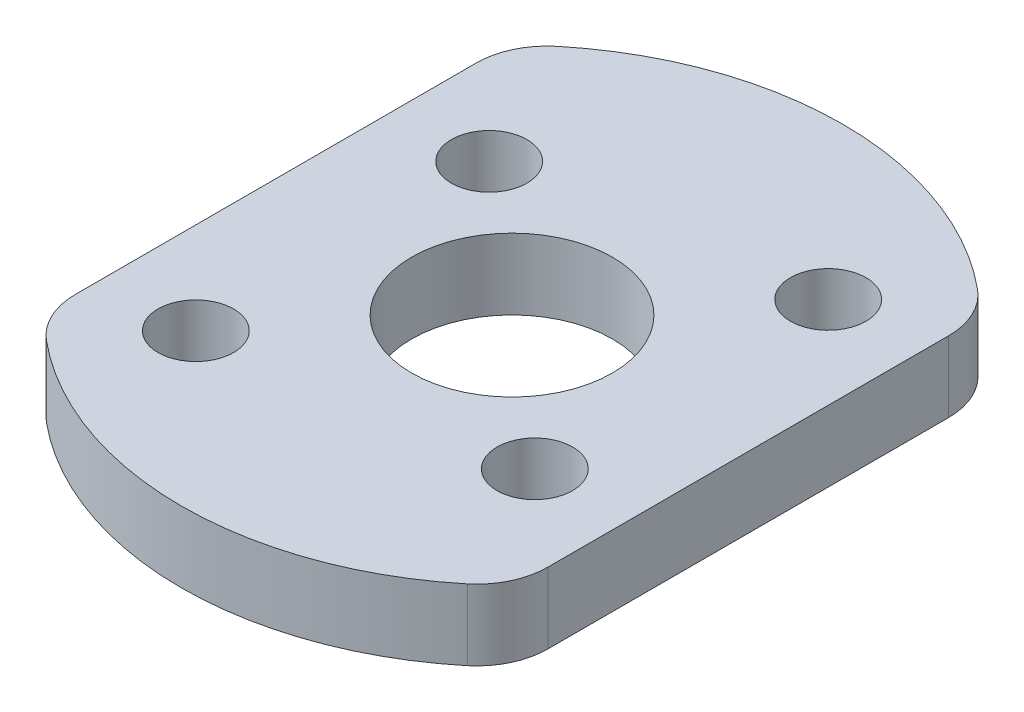
ISO-10303-21;
HEADER;
FILE_DESCRIPTION(('STEP AP214'),'2;1');
FILE_NAME('part.step','',(''),(''),'','','');
FILE_SCHEMA(('AUTOMOTIVE_DESIGN { 1 0 10303 214 1 1 1 1 }'));
ENDSEC;
DATA;
#1=APPLICATION_CONTEXT('core data for automotive mechanical design processes');
#2=APPLICATION_PROTOCOL_DEFINITION('international standard','automotive_design',2000,#1);
#3=PRODUCT_CONTEXT('',#1,'mechanical');
#4=PRODUCT('Part','Part','',(#3));
#5=PRODUCT_RELATED_PRODUCT_CATEGORY('part','',(#4));
#6=PRODUCT_DEFINITION_FORMATION('','',#4);
#7=PRODUCT_DEFINITION_CONTEXT('part definition',#1,'design');
#8=PRODUCT_DEFINITION('design','',#6,#7);
#9=PRODUCT_DEFINITION_SHAPE('','',#8);
#10=(LENGTH_UNIT() NAMED_UNIT(*) SI_UNIT(.MILLI.,.METRE.));
#11=(NAMED_UNIT(*) PLANE_ANGLE_UNIT() SI_UNIT($,.RADIAN.));
#12=(NAMED_UNIT(*) SI_UNIT($,.STERADIAN.) SOLID_ANGLE_UNIT());
#13=UNCERTAINTY_MEASURE_WITH_UNIT(LENGTH_MEASURE(1.E-05),#10,'distance_accuracy_value','');
#14=(GEOMETRIC_REPRESENTATION_CONTEXT(3) GLOBAL_UNCERTAINTY_ASSIGNED_CONTEXT((#13)) GLOBAL_UNIT_ASSIGNED_CONTEXT((#10,
#11,#12)) REPRESENTATION_CONTEXT('',''));
#15=CARTESIAN_POINT('',(0.,0.,0.));
#16=DIRECTION('',(0.,0.,1.));
#17=DIRECTION('',(1.,0.,0.));
#18=AXIS2_PLACEMENT_3D('',#15,#16,#17);
#19=CARTESIAN_POINT('',(0.,3.,0.));
#20=DIRECTION('',(0.,1.,0.));
#21=DIRECTION('',(0.,0.,1.));
#22=AXIS2_PLACEMENT_3D('',#19,#20,#21);
#23=PLANE('',#22);
#24=CARTESIAN_POINT('',(6.11928958493641,3.,5.15308596626224));
#25=DIRECTION('',(0.,1.,0.));
#26=DIRECTION('',(0.,0.,1.));
#27=AXIS2_PLACEMENT_3D('',#24,#25,#26);
#28=CIRCLE('',#27,1.6);
#29=CARTESIAN_POINT('',(6.11928958493641,3.,6.75308596626224));
#30=VERTEX_POINT('',#29);
#31=EDGE_CURVE('E186',#30,#30,#28,.T.);
#32=ORIENTED_EDGE('',*,*,#31,.F.);
#33=EDGE_LOOP('',(#32));
#34=FACE_BOUND('',#33,.T.);
#35=CARTESIAN_POINT('',(-6.11928958493641,3.,-5.15308596626224));
#36=DIRECTION('',(0.,1.,0.));
#37=DIRECTION('',(0.,0.,1.));
#38=AXIS2_PLACEMENT_3D('',#35,#36,#37);
#39=CIRCLE('',#38,1.6);
#40=CARTESIAN_POINT('',(-6.11928958493641,3.,-3.55308596626224));
#41=VERTEX_POINT('',#40);
#42=EDGE_CURVE('E175',#41,#41,#39,.T.);
#43=ORIENTED_EDGE('',*,*,#42,.F.);
#44=EDGE_LOOP('',(#43));
#45=FACE_BOUND('',#44,.T.);
#46=CARTESIAN_POINT('',(0.,3.,0.));
#47=DIRECTION('',(0.,1.,0.));
#48=DIRECTION('',(0.,0.,1.));
#49=AXIS2_PLACEMENT_3D('',#46,#47,#48);
#50=CIRCLE('',#49,14.);
#51=CARTESIAN_POINT('',(-8.90909090909091,3.,10.7994490217582));
#52=VERTEX_POINT('',#51);
#53=CARTESIAN_POINT('',(8.90909090909091,3.,10.7994490217582));
#54=VERTEX_POINT('',#53);
#55=EDGE_CURVE('E170',#52,#54,#50,.T.);
#56=ORIENTED_EDGE('',*,*,#55,.T.);
#57=CARTESIAN_POINT('',(7.,3.,8.48528137423857));
#58=DIRECTION('',(0.,1.,0.));
#59=DIRECTION('',(0.,0.,1.));
#60=AXIS2_PLACEMENT_3D('',#57,#58,#59);
#61=CIRCLE('',#60,3.);
#62=CARTESIAN_POINT('',(10.,3.,8.48528137423857));
#63=VERTEX_POINT('',#62);
#64=EDGE_CURVE('E147',#54,#63,#61,.T.);
#65=ORIENTED_EDGE('',*,*,#64,.T.);
#66=DIRECTION('',(0.,0.,-1.));
#67=VECTOR('',#66,1.);
#68=CARTESIAN_POINT('',(10.,3.,-9.79795897113271));
#69=LINE('',#68,#67);
#70=CARTESIAN_POINT('',(10.,3.,-8.48528137423857));
#71=VERTEX_POINT('',#70);
#72=EDGE_CURVE('E118',#63,#71,#69,.T.);
#73=ORIENTED_EDGE('',*,*,#72,.T.);
#74=CARTESIAN_POINT('',(7.,3.,-8.48528137423857));
#75=DIRECTION('',(0.,1.,0.));
#76=DIRECTION('',(0.,0.,1.));
#77=AXIS2_PLACEMENT_3D('',#74,#75,#76);
#78=CIRCLE('',#77,3.);
#79=CARTESIAN_POINT('',(8.90909090909091,3.,-10.7994490217582));
#80=VERTEX_POINT('',#79);
#81=EDGE_CURVE('E142',#71,#80,#78,.T.);
#82=ORIENTED_EDGE('',*,*,#81,.T.);
#83=CARTESIAN_POINT('',(0.,3.,0.));
#84=DIRECTION('',(0.,1.,0.));
#85=DIRECTION('',(0.,0.,1.));
#86=AXIS2_PLACEMENT_3D('',#83,#84,#85);
#87=CIRCLE('',#86,14.);
#88=CARTESIAN_POINT('',(-8.90909090909091,3.,-10.7994490217582));
#89=VERTEX_POINT('',#88);
#90=EDGE_CURVE('E125',#80,#89,#87,.T.);
#91=ORIENTED_EDGE('',*,*,#90,.T.);
#92=CARTESIAN_POINT('',(-7.,3.,-8.48528137423857));
#93=DIRECTION('',(0.,1.,0.));
#94=DIRECTION('',(0.,0.,1.));
#95=AXIS2_PLACEMENT_3D('',#92,#93,#94);
#96=CIRCLE('',#95,3.);
#97=CARTESIAN_POINT('',(-10.,3.,-8.48528137423857));
#98=VERTEX_POINT('',#97);
#99=EDGE_CURVE('E54',#89,#98,#96,.T.);
#100=ORIENTED_EDGE('',*,*,#99,.T.);
#101=DIRECTION('',(0.,0.,1.));
#102=VECTOR('',#101,1.);
#103=CARTESIAN_POINT('',(-10.,3.,-9.79795897113271));
#104=LINE('',#103,#102);
#105=CARTESIAN_POINT('',(-10.,3.,8.48528137423857));
#106=VERTEX_POINT('',#105);
#107=EDGE_CURVE('E128',#98,#106,#104,.T.);
#108=ORIENTED_EDGE('',*,*,#107,.T.);
#109=CARTESIAN_POINT('',(-7.,3.,8.48528137423857));
#110=DIRECTION('',(0.,1.,0.));
#111=DIRECTION('',(0.,0.,1.));
#112=AXIS2_PLACEMENT_3D('',#109,#110,#111);
#113=CIRCLE('',#112,3.);
#114=EDGE_CURVE('E145',#106,#52,#113,.T.);
#115=ORIENTED_EDGE('',*,*,#114,.T.);
#116=EDGE_LOOP('',(#56,#65,#73,#82,#91,#100,#108,#115));
#117=FACE_BOUND('',#116,.T.);
#118=CARTESIAN_POINT('',(0.,3.,0.));
#119=DIRECTION('',(0.,1.,0.));
#120=DIRECTION('',(0.,0.,1.));
#121=AXIS2_PLACEMENT_3D('',#118,#119,#120);
#122=CIRCLE('',#121,4.25);
#123=CARTESIAN_POINT('',(0.,3.,4.25));
#124=VERTEX_POINT('',#123);
#125=EDGE_CURVE('E163',#124,#124,#122,.T.);
#126=ORIENTED_EDGE('',*,*,#125,.F.);
#127=EDGE_LOOP('',(#126));
#128=FACE_BOUND('',#127,.T.);
#129=CARTESIAN_POINT('',(6.11928958493641,3.,-7.26665638211199));
#130=DIRECTION('',(0.,1.,0.));
#131=DIRECTION('',(0.,0.,1.));
#132=AXIS2_PLACEMENT_3D('',#129,#130,#131);
#133=CIRCLE('',#132,1.6);
#134=CARTESIAN_POINT('',(6.11928958493641,3.,-5.66665638211199));
#135=VERTEX_POINT('',#134);
#136=EDGE_CURVE('E180',#135,#135,#133,.T.);
#137=ORIENTED_EDGE('',*,*,#136,.F.);
#138=EDGE_LOOP('',(#137));
#139=FACE_BOUND('',#138,.T.);
#140=CARTESIAN_POINT('',(-6.11928958493641,3.,7.26665638211198));
#141=DIRECTION('',(0.,1.,0.));
#142=DIRECTION('',(0.,0.,1.));
#143=AXIS2_PLACEMENT_3D('',#140,#141,#142);
#144=CIRCLE('',#143,1.6);
#145=CARTESIAN_POINT('',(-6.11928958493641,3.,8.86665638211198));
#146=VERTEX_POINT('',#145);
#147=EDGE_CURVE('E192',#146,#146,#144,.T.);
#148=ORIENTED_EDGE('',*,*,#147,.F.);
#149=EDGE_LOOP('',(#148));
#150=FACE_BOUND('',#149,.T.);
#151=ADVANCED_FACE('F32',(#34,#45,#117,#128,#139,#150),#23,.T.);
#152=CARTESIAN_POINT('',(0.,0.,0.));
#153=DIRECTION('',(0.,1.,0.));
#154=DIRECTION('',(0.,0.,1.));
#155=AXIS2_PLACEMENT_3D('',#152,#153,#154);
#156=PLANE('',#155);
#157=CARTESIAN_POINT('',(6.11928958493641,0.,5.15308596626224));
#158=DIRECTION('',(0.,1.,0.));
#159=DIRECTION('',(0.,0.,1.));
#160=AXIS2_PLACEMENT_3D('',#157,#158,#159);
#161=CIRCLE('',#160,1.6);
#162=CARTESIAN_POINT('',(6.11928958493641,0.,6.75308596626224));
#163=VERTEX_POINT('',#162);
#164=EDGE_CURVE('E189',#163,#163,#161,.T.);
#165=ORIENTED_EDGE('',*,*,#164,.T.);
#166=EDGE_LOOP('',(#165));
#167=FACE_BOUND('',#166,.T.);
#168=CARTESIAN_POINT('',(-6.11928958493641,0.,-5.15308596626224));
#169=DIRECTION('',(0.,1.,0.));
#170=DIRECTION('',(0.,0.,1.));
#171=AXIS2_PLACEMENT_3D('',#168,#169,#170);
#172=CIRCLE('',#171,1.6);
#173=CARTESIAN_POINT('',(-6.11928958493641,0.,-3.55308596626224));
#174=VERTEX_POINT('',#173);
#175=EDGE_CURVE('E177',#174,#174,#172,.T.);
#176=ORIENTED_EDGE('',*,*,#175,.T.);
#177=EDGE_LOOP('',(#176));
#178=FACE_BOUND('',#177,.T.);
#179=DIRECTION('',(0.,0.,-1.));
#180=VECTOR('',#179,1.);
#181=CARTESIAN_POINT('',(10.,0.,-9.79795897113271));
#182=LINE('',#181,#180);
#183=CARTESIAN_POINT('',(10.,0.,8.48528137423857));
#184=VERTEX_POINT('',#183);
#185=CARTESIAN_POINT('',(10.,0.,-8.48528137423857));
#186=VERTEX_POINT('',#185);
#187=EDGE_CURVE('E115',#184,#186,#182,.T.);
#188=ORIENTED_EDGE('',*,*,#187,.F.);
#189=CARTESIAN_POINT('',(7.,0.,8.48528137423857));
#190=DIRECTION('',(0.,1.,0.));
#191=DIRECTION('',(0.,0.,1.));
#192=AXIS2_PLACEMENT_3D('',#189,#190,#191);
#193=CIRCLE('',#192,3.);
#194=CARTESIAN_POINT('',(8.90909090909091,0.,10.7994490217582));
#195=VERTEX_POINT('',#194);
#196=EDGE_CURVE('E98',#184,#195,#193,.F.);
#197=ORIENTED_EDGE('',*,*,#196,.T.);
#198=CARTESIAN_POINT('',(0.,0.,0.));
#199=DIRECTION('',(0.,1.,0.));
#200=DIRECTION('',(0.,0.,1.));
#201=AXIS2_PLACEMENT_3D('',#198,#199,#200);
#202=CIRCLE('',#201,14.);
#203=CARTESIAN_POINT('',(-8.90909090909091,0.,10.7994490217582));
#204=VERTEX_POINT('',#203);
#205=EDGE_CURVE('E126',#204,#195,#202,.T.);
#206=ORIENTED_EDGE('',*,*,#205,.F.);
#207=CARTESIAN_POINT('',(-7.,0.,8.48528137423857));
#208=DIRECTION('',(0.,1.,0.));
#209=DIRECTION('',(0.,0.,1.));
#210=AXIS2_PLACEMENT_3D('',#207,#208,#209);
#211=CIRCLE('',#210,3.);
#212=CARTESIAN_POINT('',(-10.,0.,8.48528137423857));
#213=VERTEX_POINT('',#212);
#214=EDGE_CURVE('E109',#204,#213,#211,.F.);
#215=ORIENTED_EDGE('',*,*,#214,.T.);
#216=DIRECTION('',(0.,0.,1.));
#217=VECTOR('',#216,1.);
#218=CARTESIAN_POINT('',(-10.,0.,-9.79795897113271));
#219=LINE('',#218,#217);
#220=CARTESIAN_POINT('',(-10.,0.,-8.48528137423857));
#221=VERTEX_POINT('',#220);
#222=EDGE_CURVE('E130',#221,#213,#219,.T.);
#223=ORIENTED_EDGE('',*,*,#222,.F.);
#224=CARTESIAN_POINT('',(-7.,0.,-8.48528137423857));
#225=DIRECTION('',(0.,1.,0.));
#226=DIRECTION('',(0.,0.,1.));
#227=AXIS2_PLACEMENT_3D('',#224,#225,#226);
#228=CIRCLE('',#227,3.);
#229=CARTESIAN_POINT('',(-8.90909090909091,0.,-10.7994490217582));
#230=VERTEX_POINT('',#229);
#231=EDGE_CURVE('E136',#221,#230,#228,.F.);
#232=ORIENTED_EDGE('',*,*,#231,.T.);
#233=CARTESIAN_POINT('',(0.,0.,0.));
#234=DIRECTION('',(0.,1.,0.));
#235=DIRECTION('',(0.,0.,1.));
#236=AXIS2_PLACEMENT_3D('',#233,#234,#235);
#237=CIRCLE('',#236,14.);
#238=CARTESIAN_POINT('',(8.90909090909091,0.,-10.7994490217582));
#239=VERTEX_POINT('',#238);
#240=EDGE_CURVE('E158',#239,#230,#237,.T.);
#241=ORIENTED_EDGE('',*,*,#240,.F.);
#242=CARTESIAN_POINT('',(7.,0.,-8.48528137423857));
#243=DIRECTION('',(0.,1.,0.));
#244=DIRECTION('',(0.,0.,1.));
#245=AXIS2_PLACEMENT_3D('',#242,#243,#244);
#246=CIRCLE('',#245,3.);
#247=EDGE_CURVE('E119',#239,#186,#246,.F.);
#248=ORIENTED_EDGE('',*,*,#247,.T.);
#249=EDGE_LOOP('',(#188,#197,#206,#215,#223,#232,#241,#248));
#250=FACE_BOUND('',#249,.T.);
#251=CARTESIAN_POINT('',(0.,0.,0.));
#252=DIRECTION('',(0.,1.,0.));
#253=DIRECTION('',(0.,0.,1.));
#254=AXIS2_PLACEMENT_3D('',#251,#252,#253);
#255=CIRCLE('',#254,4.25);
#256=CARTESIAN_POINT('',(0.,0.,4.25));
#257=VERTEX_POINT('',#256);
#258=EDGE_CURVE('E166',#257,#257,#255,.T.);
#259=ORIENTED_EDGE('',*,*,#258,.T.);
#260=EDGE_LOOP('',(#259));
#261=FACE_BOUND('',#260,.T.);
#262=CARTESIAN_POINT('',(6.11928958493641,0.,-7.26665638211199));
#263=DIRECTION('',(0.,1.,0.));
#264=DIRECTION('',(0.,0.,1.));
#265=AXIS2_PLACEMENT_3D('',#262,#263,#264);
#266=CIRCLE('',#265,1.6);
#267=CARTESIAN_POINT('',(6.11928958493641,0.,-5.66665638211199));
#268=VERTEX_POINT('',#267);
#269=EDGE_CURVE('E183',#268,#268,#266,.T.);
#270=ORIENTED_EDGE('',*,*,#269,.T.);
#271=EDGE_LOOP('',(#270));
#272=FACE_BOUND('',#271,.T.);
#273=CARTESIAN_POINT('',(-6.11928958493641,0.,7.26665638211198));
#274=DIRECTION('',(0.,1.,0.));
#275=DIRECTION('',(0.,0.,1.));
#276=AXIS2_PLACEMENT_3D('',#273,#274,#275);
#277=CIRCLE('',#276,1.6);
#278=CARTESIAN_POINT('',(-6.11928958493641,0.,8.86665638211198));
#279=VERTEX_POINT('',#278);
#280=EDGE_CURVE('E195',#279,#279,#277,.T.);
#281=ORIENTED_EDGE('',*,*,#280,.T.);
#282=EDGE_LOOP('',(#281));
#283=FACE_BOUND('',#282,.T.);
#284=ADVANCED_FACE('F122',(#167,#178,#250,#261,#272,#283),#156,.F.);
#285=CARTESIAN_POINT('',(0.,3.,0.));
#286=DIRECTION('',(0.,-1.,0.));
#287=DIRECTION('',(0.,0.,-1.));
#288=AXIS2_PLACEMENT_3D('',#285,#286,#287);
#289=CYLINDRICAL_SURFACE('',#288,14.);
#290=ORIENTED_EDGE('',*,*,#240,.T.);
#291=DIRECTION('',(0.,-1.,0.));
#292=VECTOR('',#291,1.);
#293=CARTESIAN_POINT('',(-8.90909090909091,3.,-10.7994490217582));
#294=LINE('',#293,#292);
#295=EDGE_CURVE('E11',#230,#89,#294,.F.);
#296=ORIENTED_EDGE('',*,*,#295,.T.);
#297=ORIENTED_EDGE('',*,*,#90,.F.);
#298=DIRECTION('',(0.,-1.,0.));
#299=VECTOR('',#298,1.);
#300=CARTESIAN_POINT('',(8.90909090909091,3.,-10.7994490217582));
#301=LINE('',#300,#299);
#302=EDGE_CURVE('E40',#80,#239,#301,.T.);
#303=ORIENTED_EDGE('',*,*,#302,.T.);
#304=EDGE_LOOP('',(#290,#296,#297,#303));
#305=FACE_BOUND('',#304,.T.);
#306=ADVANCED_FACE('F157',(#305),#289,.T.);
#307=CARTESIAN_POINT('',(-10.,3.,-9.79795897113271));
#308=DIRECTION('',(1.,0.,0.));
#309=DIRECTION('',(0.,0.,-1.));
#310=AXIS2_PLACEMENT_3D('',#307,#308,#309);
#311=PLANE('',#310);
#312=ORIENTED_EDGE('',*,*,#222,.T.);
#313=DIRECTION('',(0.,-1.,0.));
#314=VECTOR('',#313,1.);
#315=CARTESIAN_POINT('',(-10.,3.,8.48528137423857));
#316=LINE('',#315,#314);
#317=EDGE_CURVE('E47',#213,#106,#316,.F.);
#318=ORIENTED_EDGE('',*,*,#317,.T.);
#319=ORIENTED_EDGE('',*,*,#107,.F.);
#320=DIRECTION('',(0.,-1.,0.));
#321=VECTOR('',#320,1.);
#322=CARTESIAN_POINT('',(-10.,3.,-8.48528137423857));
#323=LINE('',#322,#321);
#324=EDGE_CURVE('E149',#98,#221,#323,.T.);
#325=ORIENTED_EDGE('',*,*,#324,.T.);
#326=EDGE_LOOP('',(#312,#318,#319,#325));
#327=FACE_BOUND('',#326,.T.);
#328=ADVANCED_FACE('F223',(#327),#311,.F.);
#329=CARTESIAN_POINT('',(0.,3.,0.));
#330=DIRECTION('',(0.,-1.,0.));
#331=DIRECTION('',(0.,0.,-1.));
#332=AXIS2_PLACEMENT_3D('',#329,#330,#331);
#333=CYLINDRICAL_SURFACE('',#332,14.);
#334=ORIENTED_EDGE('',*,*,#205,.T.);
#335=DIRECTION('',(0.,-1.,0.));
#336=VECTOR('',#335,1.);
#337=CARTESIAN_POINT('',(8.90909090909091,3.,10.7994490217582));
#338=LINE('',#337,#336);
#339=EDGE_CURVE('E103',#195,#54,#338,.F.);
#340=ORIENTED_EDGE('',*,*,#339,.T.);
#341=ORIENTED_EDGE('',*,*,#55,.F.);
#342=DIRECTION('',(0.,-1.,0.));
#343=VECTOR('',#342,1.);
#344=CARTESIAN_POINT('',(-8.90909090909091,3.,10.7994490217582));
#345=LINE('',#344,#343);
#346=EDGE_CURVE('E108',#52,#204,#345,.T.);
#347=ORIENTED_EDGE('',*,*,#346,.T.);
#348=EDGE_LOOP('',(#334,#340,#341,#347));
#349=FACE_BOUND('',#348,.T.);
#350=ADVANCED_FACE('F220',(#349),#333,.T.);
#351=CARTESIAN_POINT('',(10.,3.,-9.79795897113271));
#352=DIRECTION('',(-1.,0.,0.));
#353=DIRECTION('',(0.,0.,1.));
#354=AXIS2_PLACEMENT_3D('',#351,#352,#353);
#355=PLANE('',#354);
#356=ORIENTED_EDGE('',*,*,#72,.F.);
#357=DIRECTION('',(0.,-1.,0.));
#358=VECTOR('',#357,1.);
#359=CARTESIAN_POINT('',(10.,3.,8.48528137423857));
#360=LINE('',#359,#358);
#361=EDGE_CURVE('E102',#63,#184,#360,.T.);
#362=ORIENTED_EDGE('',*,*,#361,.T.);
#363=ORIENTED_EDGE('',*,*,#187,.T.);
#364=DIRECTION('',(0.,-1.,0.));
#365=VECTOR('',#364,1.);
#366=CARTESIAN_POINT('',(10.,3.,-8.48528137423857));
#367=LINE('',#366,#365);
#368=EDGE_CURVE('E120',#186,#71,#367,.F.);
#369=ORIENTED_EDGE('',*,*,#368,.T.);
#370=EDGE_LOOP('',(#356,#362,#363,#369));
#371=FACE_BOUND('',#370,.T.);
#372=ADVANCED_FACE('F114',(#371),#355,.F.);
#373=CARTESIAN_POINT('',(0.,3.,0.));
#374=DIRECTION('',(0.,-1.,0.));
#375=DIRECTION('',(0.,0.,-1.));
#376=AXIS2_PLACEMENT_3D('',#373,#374,#375);
#377=CYLINDRICAL_SURFACE('',#376,4.25);
#378=ORIENTED_EDGE('',*,*,#125,.T.);
#379=EDGE_LOOP('',(#378));
#380=FACE_BOUND('',#379,.T.);
#381=ORIENTED_EDGE('',*,*,#258,.F.);
#382=EDGE_LOOP('',(#381));
#383=FACE_BOUND('',#382,.T.);
#384=ADVANCED_FACE('F215',(#380,#383),#377,.F.);
#385=CARTESIAN_POINT('',(-6.11928958493641,3.,-5.15308596626224));
#386=DIRECTION('',(0.,-1.,0.));
#387=DIRECTION('',(0.,0.,-1.));
#388=AXIS2_PLACEMENT_3D('',#385,#386,#387);
#389=CYLINDRICAL_SURFACE('',#388,1.6);
#390=ORIENTED_EDGE('',*,*,#42,.T.);
#391=EDGE_LOOP('',(#390));
#392=FACE_BOUND('',#391,.T.);
#393=ORIENTED_EDGE('',*,*,#175,.F.);
#394=EDGE_LOOP('',(#393));
#395=FACE_BOUND('',#394,.T.);
#396=ADVANCED_FACE('F253',(#392,#395),#389,.F.);
#397=CARTESIAN_POINT('',(6.11928958493641,3.,-7.26665638211199));
#398=DIRECTION('',(0.,-1.,0.));
#399=DIRECTION('',(0.,0.,-1.));
#400=AXIS2_PLACEMENT_3D('',#397,#398,#399);
#401=CYLINDRICAL_SURFACE('',#400,1.6);
#402=ORIENTED_EDGE('',*,*,#136,.T.);
#403=EDGE_LOOP('',(#402));
#404=FACE_BOUND('',#403,.T.);
#405=ORIENTED_EDGE('',*,*,#269,.F.);
#406=EDGE_LOOP('',(#405));
#407=FACE_BOUND('',#406,.T.);
#408=ADVANCED_FACE('F249',(#404,#407),#401,.F.);
#409=CARTESIAN_POINT('',(6.11928958493641,3.,5.15308596626224));
#410=DIRECTION('',(0.,-1.,0.));
#411=DIRECTION('',(0.,0.,-1.));
#412=AXIS2_PLACEMENT_3D('',#409,#410,#411);
#413=CYLINDRICAL_SURFACE('',#412,1.6);
#414=ORIENTED_EDGE('',*,*,#31,.T.);
#415=EDGE_LOOP('',(#414));
#416=FACE_BOUND('',#415,.T.);
#417=ORIENTED_EDGE('',*,*,#164,.F.);
#418=EDGE_LOOP('',(#417));
#419=FACE_BOUND('',#418,.T.);
#420=ADVANCED_FACE('F252',(#416,#419),#413,.F.);
#421=CARTESIAN_POINT('',(-6.11928958493641,3.,7.26665638211198));
#422=DIRECTION('',(0.,-1.,0.));
#423=DIRECTION('',(0.,0.,-1.));
#424=AXIS2_PLACEMENT_3D('',#421,#422,#423);
#425=CYLINDRICAL_SURFACE('',#424,1.6);
#426=ORIENTED_EDGE('',*,*,#147,.T.);
#427=EDGE_LOOP('',(#426));
#428=FACE_BOUND('',#427,.T.);
#429=ORIENTED_EDGE('',*,*,#280,.F.);
#430=EDGE_LOOP('',(#429));
#431=FACE_BOUND('',#430,.T.);
#432=ADVANCED_FACE('F201',(#428,#431),#425,.F.);
#433=CARTESIAN_POINT('',(7.,3.,8.48528137423857));
#434=DIRECTION('',(0.,-1.,0.));
#435=DIRECTION('',(0.,0.,-1.));
#436=AXIS2_PLACEMENT_3D('',#433,#434,#435);
#437=CYLINDRICAL_SURFACE('',#436,3.);
#438=ORIENTED_EDGE('',*,*,#64,.F.);
#439=ORIENTED_EDGE('',*,*,#339,.F.);
#440=ORIENTED_EDGE('',*,*,#196,.F.);
#441=ORIENTED_EDGE('',*,*,#361,.F.);
#442=EDGE_LOOP('',(#438,#439,#440,#441));
#443=FACE_BOUND('',#442,.T.);
#444=ADVANCED_FACE('F101',(#443),#437,.T.);
#445=CARTESIAN_POINT('',(-7.,3.,8.48528137423857));
#446=DIRECTION('',(0.,-1.,0.));
#447=DIRECTION('',(0.,0.,-1.));
#448=AXIS2_PLACEMENT_3D('',#445,#446,#447);
#449=CYLINDRICAL_SURFACE('',#448,3.);
#450=ORIENTED_EDGE('',*,*,#114,.F.);
#451=ORIENTED_EDGE('',*,*,#317,.F.);
#452=ORIENTED_EDGE('',*,*,#214,.F.);
#453=ORIENTED_EDGE('',*,*,#346,.F.);
#454=EDGE_LOOP('',(#450,#451,#452,#453));
#455=FACE_BOUND('',#454,.T.);
#456=ADVANCED_FACE('F231',(#455),#449,.T.);
#457=CARTESIAN_POINT('',(-7.,3.,-8.48528137423857));
#458=DIRECTION('',(0.,-1.,0.));
#459=DIRECTION('',(0.,0.,-1.));
#460=AXIS2_PLACEMENT_3D('',#457,#458,#459);
#461=CYLINDRICAL_SURFACE('',#460,3.);
#462=ORIENTED_EDGE('',*,*,#99,.F.);
#463=ORIENTED_EDGE('',*,*,#295,.F.);
#464=ORIENTED_EDGE('',*,*,#231,.F.);
#465=ORIENTED_EDGE('',*,*,#324,.F.);
#466=EDGE_LOOP('',(#462,#463,#464,#465));
#467=FACE_BOUND('',#466,.T.);
#468=ADVANCED_FACE('F233',(#467),#461,.T.);
#469=CARTESIAN_POINT('',(7.,3.,-8.48528137423857));
#470=DIRECTION('',(0.,-1.,0.));
#471=DIRECTION('',(0.,0.,-1.));
#472=AXIS2_PLACEMENT_3D('',#469,#470,#471);
#473=CYLINDRICAL_SURFACE('',#472,3.);
#474=ORIENTED_EDGE('',*,*,#81,.F.);
#475=ORIENTED_EDGE('',*,*,#368,.F.);
#476=ORIENTED_EDGE('',*,*,#247,.F.);
#477=ORIENTED_EDGE('',*,*,#302,.F.);
#478=EDGE_LOOP('',(#474,#475,#476,#477));
#479=FACE_BOUND('',#478,.T.);
#480=ADVANCED_FACE('F34',(#479),#473,.T.);
#481=CLOSED_SHELL('',(#151,#284,#306,#328,#350,#372,#384,#396,#408,#420,#432,#444,#456,#468,#480));
#482=MANIFOLD_SOLID_BREP('B2',#481);
#483=ADVANCED_BREP_SHAPE_REPRESENTATION('',(#18,#482),#14);
#484=SHAPE_DEFINITION_REPRESENTATION(#9,#483);
ENDSEC;
END-ISO-10303-21;
